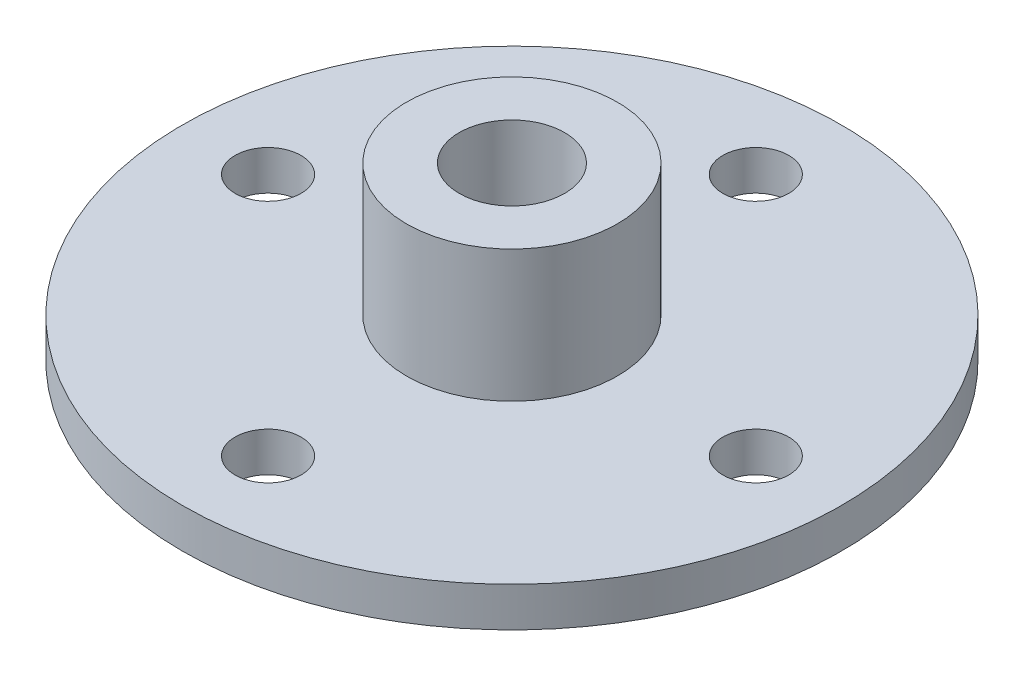
ISO-10303-21;
HEADER;
FILE_DESCRIPTION(('STEP AP214'),'2;1');
FILE_NAME('part.step','',(''),(''),'','','');
FILE_SCHEMA(('AUTOMOTIVE_DESIGN { 1 0 10303 214 1 1 1 1 }'));
ENDSEC;
DATA;
#1=APPLICATION_CONTEXT('core data for automotive mechanical design processes');
#2=APPLICATION_PROTOCOL_DEFINITION('international standard','automotive_design',2000,#1);
#3=PRODUCT_CONTEXT('',#1,'mechanical');
#4=PRODUCT('Part','Part','',(#3));
#5=PRODUCT_RELATED_PRODUCT_CATEGORY('part','',(#4));
#6=PRODUCT_DEFINITION_FORMATION('','',#4);
#7=PRODUCT_DEFINITION_CONTEXT('part definition',#1,'design');
#8=PRODUCT_DEFINITION('design','',#6,#7);
#9=PRODUCT_DEFINITION_SHAPE('','',#8);
#10=(LENGTH_UNIT() NAMED_UNIT(*) SI_UNIT(.MILLI.,.METRE.));
#11=(NAMED_UNIT(*) PLANE_ANGLE_UNIT() SI_UNIT($,.RADIAN.));
#12=(NAMED_UNIT(*) SI_UNIT($,.STERADIAN.) SOLID_ANGLE_UNIT());
#13=UNCERTAINTY_MEASURE_WITH_UNIT(LENGTH_MEASURE(1.E-05),#10,'distance_accuracy_value','');
#14=(GEOMETRIC_REPRESENTATION_CONTEXT(3) GLOBAL_UNCERTAINTY_ASSIGNED_CONTEXT((#13)) GLOBAL_UNIT_ASSIGNED_CONTEXT((#10,
#11,#12)) REPRESENTATION_CONTEXT('',''));
#15=CARTESIAN_POINT('',(0.,0.,0.));
#16=DIRECTION('',(0.,0.,1.));
#17=DIRECTION('',(1.,0.,0.));
#18=AXIS2_PLACEMENT_3D('',#15,#16,#17);
#19=CARTESIAN_POINT('',(0.,3.,-18.5));
#20=DIRECTION('',(0.,-1.,0.));
#21=DIRECTION('',(0.,0.,-1.));
#22=AXIS2_PLACEMENT_3D('',#19,#20,#21);
#23=CYLINDRICAL_SURFACE('',#22,2.5);
#24=CARTESIAN_POINT('',(0.,3.,-18.5));
#25=DIRECTION('',(0.,1.,0.));
#26=DIRECTION('',(0.,0.,1.));
#27=AXIS2_PLACEMENT_3D('',#24,#25,#26);
#28=CIRCLE('',#27,2.5);
#29=CARTESIAN_POINT('',(0.,3.,-16.));
#30=VERTEX_POINT('',#29);
#31=EDGE_CURVE('E42',#30,#30,#28,.T.);
#32=ORIENTED_EDGE('',*,*,#31,.T.);
#33=EDGE_LOOP('',(#32));
#34=FACE_BOUND('',#33,.T.);
#35=CARTESIAN_POINT('',(0.,0.,-18.5));
#36=DIRECTION('',(0.,1.,0.));
#37=DIRECTION('',(0.,0.,1.));
#38=AXIS2_PLACEMENT_3D('',#35,#36,#37);
#39=CIRCLE('',#38,2.5);
#40=CARTESIAN_POINT('',(0.,0.,-16.));
#41=VERTEX_POINT('',#40);
#42=EDGE_CURVE('E61',#41,#41,#39,.T.);
#43=ORIENTED_EDGE('',*,*,#42,.F.);
#44=EDGE_LOOP('',(#43));
#45=FACE_BOUND('',#44,.T.);
#46=ADVANCED_FACE('F31',(#34,#45),#23,.F.);
#47=CARTESIAN_POINT('',(18.5,3.,1.26919212958773E-13));
#48=DIRECTION('',(0.,-1.,0.));
#49=DIRECTION('',(0.,0.,-1.));
#50=AXIS2_PLACEMENT_3D('',#47,#48,#49);
#51=CYLINDRICAL_SURFACE('',#50,2.5);
#52=CARTESIAN_POINT('',(18.5,3.,1.26919212958773E-13));
#53=DIRECTION('',(0.,1.,0.));
#54=DIRECTION('',(0.,0.,1.));
#55=AXIS2_PLACEMENT_3D('',#52,#53,#54);
#56=CIRCLE('',#55,2.5);
#57=CARTESIAN_POINT('',(18.5,3.,2.50000000000012));
#58=VERTEX_POINT('',#57);
#59=EDGE_CURVE('E47',#58,#58,#56,.T.);
#60=ORIENTED_EDGE('',*,*,#59,.T.);
#61=EDGE_LOOP('',(#60));
#62=FACE_BOUND('',#61,.T.);
#63=CARTESIAN_POINT('',(18.5,0.,1.26919212958773E-13));
#64=DIRECTION('',(0.,1.,0.));
#65=DIRECTION('',(0.,0.,1.));
#66=AXIS2_PLACEMENT_3D('',#63,#64,#65);
#67=CIRCLE('',#66,2.5);
#68=CARTESIAN_POINT('',(18.5,0.,2.50000000000012));
#69=VERTEX_POINT('',#68);
#70=EDGE_CURVE('E58',#69,#69,#67,.T.);
#71=ORIENTED_EDGE('',*,*,#70,.F.);
#72=EDGE_LOOP('',(#71));
#73=FACE_BOUND('',#72,.T.);
#74=ADVANCED_FACE('F81',(#62,#73),#51,.F.);
#75=CARTESIAN_POINT('',(-1.91511617727371E-13,3.,18.5));
#76=DIRECTION('',(0.,-1.,0.));
#77=DIRECTION('',(0.,0.,-1.));
#78=AXIS2_PLACEMENT_3D('',#75,#76,#77);
#79=CYLINDRICAL_SURFACE('',#78,2.5);
#80=CARTESIAN_POINT('',(-1.91511617727371E-13,3.,18.5));
#81=DIRECTION('',(0.,1.,0.));
#82=DIRECTION('',(0.,0.,1.));
#83=AXIS2_PLACEMENT_3D('',#80,#81,#82);
#84=CIRCLE('',#83,2.5);
#85=CARTESIAN_POINT('',(-1.91511617727371E-13,3.,21.));
#86=VERTEX_POINT('',#85);
#87=EDGE_CURVE('E69',#86,#86,#84,.T.);
#88=ORIENTED_EDGE('',*,*,#87,.T.);
#89=EDGE_LOOP('',(#88));
#90=FACE_BOUND('',#89,.T.);
#91=CARTESIAN_POINT('',(-1.91511617727371E-13,0.,18.5));
#92=DIRECTION('',(0.,1.,0.));
#93=DIRECTION('',(0.,0.,1.));
#94=AXIS2_PLACEMENT_3D('',#91,#92,#93);
#95=CIRCLE('',#94,2.5);
#96=CARTESIAN_POINT('',(-1.91511617727371E-13,0.,21.));
#97=VERTEX_POINT('',#96);
#98=EDGE_CURVE('E54',#97,#97,#95,.T.);
#99=ORIENTED_EDGE('',*,*,#98,.F.);
#100=EDGE_LOOP('',(#99));
#101=FACE_BOUND('',#100,.T.);
#102=ADVANCED_FACE('F117',(#90,#101),#79,.F.);
#103=CARTESIAN_POINT('',(-18.5,3.,0.));
#104=DIRECTION('',(0.,-1.,0.));
#105=DIRECTION('',(0.,0.,-1.));
#106=AXIS2_PLACEMENT_3D('',#103,#104,#105);
#107=CYLINDRICAL_SURFACE('',#106,2.5);
#108=CARTESIAN_POINT('',(-18.5,3.,0.));
#109=DIRECTION('',(0.,1.,0.));
#110=DIRECTION('',(0.,0.,1.));
#111=AXIS2_PLACEMENT_3D('',#108,#109,#110);
#112=CIRCLE('',#111,2.5);
#113=CARTESIAN_POINT('',(-18.5,3.,2.5));
#114=VERTEX_POINT('',#113);
#115=EDGE_CURVE('E65',#114,#114,#112,.T.);
#116=ORIENTED_EDGE('',*,*,#115,.T.);
#117=EDGE_LOOP('',(#116));
#118=FACE_BOUND('',#117,.T.);
#119=CARTESIAN_POINT('',(-18.5,0.,0.));
#120=DIRECTION('',(0.,1.,0.));
#121=DIRECTION('',(0.,0.,1.));
#122=AXIS2_PLACEMENT_3D('',#119,#120,#121);
#123=CIRCLE('',#122,2.5);
#124=CARTESIAN_POINT('',(-18.5,0.,2.5));
#125=VERTEX_POINT('',#124);
#126=EDGE_CURVE('E51',#125,#125,#123,.T.);
#127=ORIENTED_EDGE('',*,*,#126,.F.);
#128=EDGE_LOOP('',(#127));
#129=FACE_BOUND('',#128,.T.);
#130=ADVANCED_FACE('F33',(#118,#129),#107,.F.);
#131=CARTESIAN_POINT('',(0.,3.,0.));
#132=DIRECTION('',(0.,-1.,0.));
#133=DIRECTION('',(0.,0.,-1.));
#134=AXIS2_PLACEMENT_3D('',#131,#132,#133);
#135=CYLINDRICAL_SURFACE('',#134,25.);
#136=CARTESIAN_POINT('',(0.,3.,0.));
#137=DIRECTION('',(0.,1.,0.));
#138=DIRECTION('',(0.,0.,1.));
#139=AXIS2_PLACEMENT_3D('',#136,#137,#138);
#140=CIRCLE('',#139,25.);
#141=CARTESIAN_POINT('',(0.,3.,25.));
#142=VERTEX_POINT('',#141);
#143=EDGE_CURVE('E38',#142,#142,#140,.T.);
#144=ORIENTED_EDGE('',*,*,#143,.F.);
#145=EDGE_LOOP('',(#144));
#146=FACE_BOUND('',#145,.T.);
#147=CARTESIAN_POINT('',(0.,0.,0.));
#148=DIRECTION('',(0.,1.,0.));
#149=DIRECTION('',(0.,0.,1.));
#150=AXIS2_PLACEMENT_3D('',#147,#148,#149);
#151=CIRCLE('',#150,25.);
#152=CARTESIAN_POINT('',(0.,0.,25.));
#153=VERTEX_POINT('',#152);
#154=EDGE_CURVE('E63',#153,#153,#151,.T.);
#155=ORIENTED_EDGE('',*,*,#154,.T.);
#156=EDGE_LOOP('',(#155));
#157=FACE_BOUND('',#156,.T.);
#158=ADVANCED_FACE('F88',(#146,#157),#135,.T.);
#159=CARTESIAN_POINT('',(0.,3.,0.));
#160=DIRECTION('',(0.,1.,0.));
#161=DIRECTION('',(0.,0.,1.));
#162=AXIS2_PLACEMENT_3D('',#159,#160,#161);
#163=PLANE('',#162);
#164=CARTESIAN_POINT('',(0.,3.,0.));
#165=DIRECTION('',(0.,1.,0.));
#166=DIRECTION('',(0.,0.,1.));
#167=AXIS2_PLACEMENT_3D('',#164,#165,#166);
#168=CIRCLE('',#167,8.);
#169=CARTESIAN_POINT('',(0.,3.,8.));
#170=VERTEX_POINT('',#169);
#171=EDGE_CURVE('E76',#170,#170,#168,.T.);
#172=ORIENTED_EDGE('',*,*,#171,.F.);
#173=EDGE_LOOP('',(#172));
#174=FACE_BOUND('',#173,.T.);
#175=ORIENTED_EDGE('',*,*,#115,.F.);
#176=EDGE_LOOP('',(#175));
#177=FACE_BOUND('',#176,.T.);
#178=ORIENTED_EDGE('',*,*,#87,.F.);
#179=EDGE_LOOP('',(#178));
#180=FACE_BOUND('',#179,.T.);
#181=ORIENTED_EDGE('',*,*,#59,.F.);
#182=EDGE_LOOP('',(#181));
#183=FACE_BOUND('',#182,.T.);
#184=ORIENTED_EDGE('',*,*,#31,.F.);
#185=EDGE_LOOP('',(#184));
#186=FACE_BOUND('',#185,.T.);
#187=ORIENTED_EDGE('',*,*,#143,.T.);
#188=EDGE_LOOP('',(#187));
#189=FACE_BOUND('',#188,.T.);
#190=ADVANCED_FACE('F84',(#174,#177,#180,#183,#186,#189),#163,.T.);
#191=CARTESIAN_POINT('',(0.,0.,0.));
#192=DIRECTION('',(0.,1.,0.));
#193=DIRECTION('',(0.,0.,1.));
#194=AXIS2_PLACEMENT_3D('',#191,#192,#193);
#195=PLANE('',#194);
#196=ORIENTED_EDGE('',*,*,#126,.T.);
#197=EDGE_LOOP('',(#196));
#198=FACE_BOUND('',#197,.T.);
#199=ORIENTED_EDGE('',*,*,#98,.T.);
#200=EDGE_LOOP('',(#199));
#201=FACE_BOUND('',#200,.T.);
#202=ORIENTED_EDGE('',*,*,#70,.T.);
#203=EDGE_LOOP('',(#202));
#204=FACE_BOUND('',#203,.T.);
#205=ORIENTED_EDGE('',*,*,#42,.T.);
#206=EDGE_LOOP('',(#205));
#207=FACE_BOUND('',#206,.T.);
#208=ORIENTED_EDGE('',*,*,#154,.F.);
#209=EDGE_LOOP('',(#208));
#210=FACE_BOUND('',#209,.T.);
#211=ADVANCED_FACE('F87',(#198,#201,#204,#207,#210),#195,.F.);
#212=CARTESIAN_POINT('',(0.,13.,0.));
#213=DIRECTION('',(0.,1.,0.));
#214=DIRECTION('',(0.,0.,1.));
#215=AXIS2_PLACEMENT_3D('',#212,#213,#214);
#216=PLANE('',#215);
#217=CARTESIAN_POINT('',(0.,13.,0.));
#218=DIRECTION('',(0.,1.,0.));
#219=DIRECTION('',(0.,0.,1.));
#220=AXIS2_PLACEMENT_3D('',#217,#218,#219);
#221=CIRCLE('',#220,8.);
#222=CARTESIAN_POINT('',(0.,13.,8.));
#223=VERTEX_POINT('',#222);
#224=EDGE_CURVE('E55',#223,#223,#221,.T.);
#225=ORIENTED_EDGE('',*,*,#224,.T.);
#226=EDGE_LOOP('',(#225));
#227=FACE_BOUND('',#226,.T.);
#228=CARTESIAN_POINT('',(0.,13.,0.));
#229=DIRECTION('',(0.,1.,0.));
#230=DIRECTION('',(0.,0.,1.));
#231=AXIS2_PLACEMENT_3D('',#228,#229,#230);
#232=CIRCLE('',#231,4.);
#233=CARTESIAN_POINT('',(0.,13.,4.));
#234=VERTEX_POINT('',#233);
#235=EDGE_CURVE('E183',#234,#234,#232,.T.);
#236=ORIENTED_EDGE('',*,*,#235,.F.);
#237=EDGE_LOOP('',(#236));
#238=FACE_BOUND('',#237,.T.);
#239=ADVANCED_FACE('F101',(#227,#238),#216,.T.);
#240=CARTESIAN_POINT('',(0.,13.,0.));
#241=DIRECTION('',(0.,-1.,0.));
#242=DIRECTION('',(0.,0.,-1.));
#243=AXIS2_PLACEMENT_3D('',#240,#241,#242);
#244=CYLINDRICAL_SURFACE('',#243,8.);
#245=ORIENTED_EDGE('',*,*,#224,.F.);
#246=EDGE_LOOP('',(#245));
#247=FACE_BOUND('',#246,.T.);
#248=ORIENTED_EDGE('',*,*,#171,.T.);
#249=EDGE_LOOP('',(#248));
#250=FACE_BOUND('',#249,.T.);
#251=ADVANCED_FACE('F107',(#247,#250),#244,.T.);
#252=CARTESIAN_POINT('',(0.,13.,0.));
#253=DIRECTION('',(0.,-1.,0.));
#254=DIRECTION('',(0.,0.,-1.));
#255=AXIS2_PLACEMENT_3D('',#252,#253,#254);
#256=CYLINDRICAL_SURFACE('',#255,4.);
#257=ORIENTED_EDGE('',*,*,#235,.T.);
#258=EDGE_LOOP('',(#257));
#259=FACE_BOUND('',#258,.T.);
#260=CARTESIAN_POINT('',(0.,3.,0.));
#261=DIRECTION('',(0.,1.,0.));
#262=DIRECTION('',(0.,0.,1.));
#263=AXIS2_PLACEMENT_3D('',#260,#261,#262);
#264=CIRCLE('',#263,4.);
#265=CARTESIAN_POINT('',(0.,3.,4.));
#266=VERTEX_POINT('',#265);
#267=EDGE_CURVE('E10',#266,#266,#264,.F.);
#268=ORIENTED_EDGE('',*,*,#267,.T.);
#269=EDGE_LOOP('',(#268));
#270=FACE_BOUND('',#269,.T.);
#271=ADVANCED_FACE('F159',(#259,#270),#256,.F.);
#272=ORIENTED_EDGE('',*,*,#267,.F.);
#273=EDGE_LOOP('',(#272));
#274=FACE_BOUND('',#273,.T.);
#275=ADVANCED_FACE('F91',(#274),#163,.T.);
#276=CLOSED_SHELL('',(#46,#74,#102,#130,#158,#190,#211,#239,#251,#271,#275));
#277=MANIFOLD_SOLID_BREP('B2',#276);
#278=ADVANCED_BREP_SHAPE_REPRESENTATION('',(#18,#277),#14);
#279=SHAPE_DEFINITION_REPRESENTATION(#9,#278);
ENDSEC;
END-ISO-10303-21;
